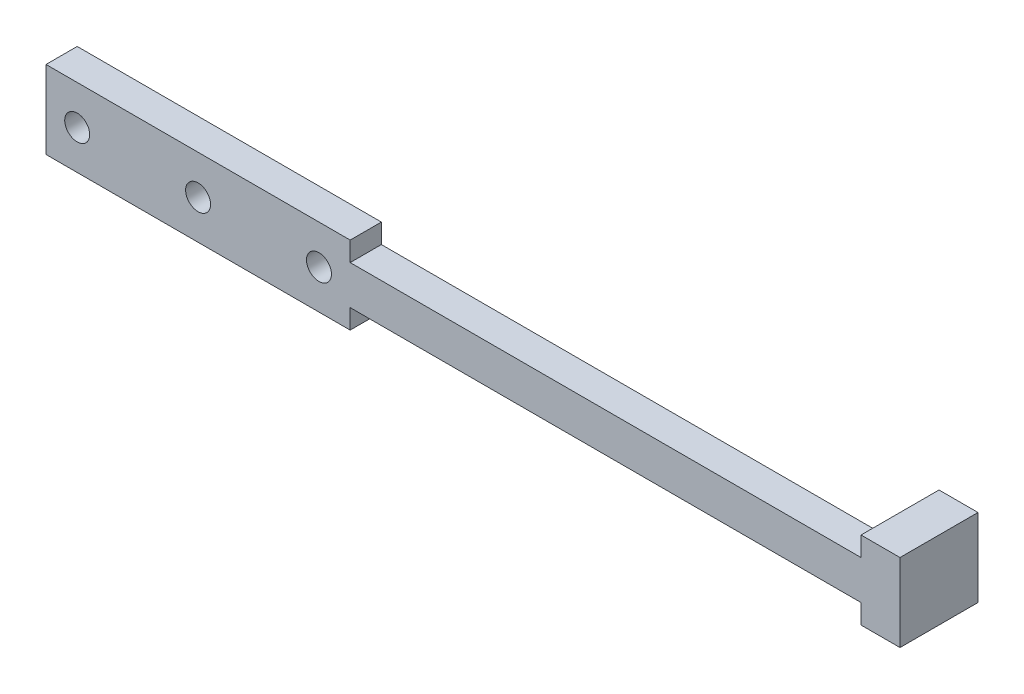
ISO-10303-21;
HEADER;
FILE_DESCRIPTION(('STEP AP214'),'2;1');
FILE_NAME('part.step','',(''),(''),'','','');
FILE_SCHEMA(('AUTOMOTIVE_DESIGN { 1 0 10303 214 1 1 1 1 }'));
ENDSEC;
DATA;
#1=APPLICATION_CONTEXT('core data for automotive mechanical design processes');
#2=APPLICATION_PROTOCOL_DEFINITION('international standard','automotive_design',2000,#1);
#3=PRODUCT_CONTEXT('',#1,'mechanical');
#4=PRODUCT('Part','Part','',(#3));
#5=PRODUCT_RELATED_PRODUCT_CATEGORY('part','',(#4));
#6=PRODUCT_DEFINITION_FORMATION('','',#4);
#7=PRODUCT_DEFINITION_CONTEXT('part definition',#1,'design');
#8=PRODUCT_DEFINITION('design','',#6,#7);
#9=PRODUCT_DEFINITION_SHAPE('','',#8);
#10=(LENGTH_UNIT() NAMED_UNIT(*) SI_UNIT(.MILLI.,.METRE.));
#11=(NAMED_UNIT(*) PLANE_ANGLE_UNIT() SI_UNIT($,.RADIAN.));
#12=(NAMED_UNIT(*) SI_UNIT($,.STERADIAN.) SOLID_ANGLE_UNIT());
#13=UNCERTAINTY_MEASURE_WITH_UNIT(LENGTH_MEASURE(1.E-05),#10,'distance_accuracy_value','');
#14=(GEOMETRIC_REPRESENTATION_CONTEXT(3) GLOBAL_UNCERTAINTY_ASSIGNED_CONTEXT((#13)) GLOBAL_UNIT_ASSIGNED_CONTEXT((#10,
#11,#12)) REPRESENTATION_CONTEXT('',''));
#15=CARTESIAN_POINT('',(0.,0.,0.));
#16=DIRECTION('',(0.,0.,1.));
#17=DIRECTION('',(1.,0.,0.));
#18=AXIS2_PLACEMENT_3D('',#15,#16,#17);
#19=CARTESIAN_POINT('',(-32.75,0.,4.));
#20=DIRECTION('',(1.,0.,0.));
#21=DIRECTION('',(0.,0.,-1.));
#22=AXIS2_PLACEMENT_3D('',#19,#20,#21);
#23=PLANE('',#22);
#24=DIRECTION('',(0.,-1.,0.));
#25=VECTOR('',#24,1.);
#26=CARTESIAN_POINT('',(-32.75,0.,0.));
#27=LINE('',#26,#25);
#28=CARTESIAN_POINT('',(-32.75,5.,0.));
#29=VERTEX_POINT('',#28);
#30=CARTESIAN_POINT('',(-32.75,2.5,0.));
#31=VERTEX_POINT('',#30);
#32=EDGE_CURVE('E187',#29,#31,#27,.T.);
#33=ORIENTED_EDGE('',*,*,#32,.F.);
#34=DIRECTION('',(0.,0.,-1.));
#35=VECTOR('',#34,1.);
#36=CARTESIAN_POINT('',(-32.75,5.,4.));
#37=LINE('',#36,#35);
#38=CARTESIAN_POINT('',(-32.75,5.,4.));
#39=VERTEX_POINT('',#38);
#40=EDGE_CURVE('E11',#39,#29,#37,.T.);
#41=ORIENTED_EDGE('',*,*,#40,.F.);
#42=DIRECTION('',(0.,-1.,0.));
#43=VECTOR('',#42,1.);
#44=CARTESIAN_POINT('',(-32.75,0.,4.));
#45=LINE('',#44,#43);
#46=CARTESIAN_POINT('',(-32.75,2.5,4.));
#47=VERTEX_POINT('',#46);
#48=EDGE_CURVE('E168',#39,#47,#45,.T.);
#49=ORIENTED_EDGE('',*,*,#48,.T.);
#50=DIRECTION('',(0.,0.,-1.));
#51=VECTOR('',#50,1.);
#52=CARTESIAN_POINT('',(-32.75,2.5,4.));
#53=LINE('',#52,#51);
#54=EDGE_CURVE('E52',#47,#31,#53,.T.);
#55=ORIENTED_EDGE('',*,*,#54,.T.);
#56=EDGE_LOOP('',(#33,#41,#49,#55));
#57=FACE_BOUND('',#56,.T.);
#58=ADVANCED_FACE('F35',(#57),#23,.T.);
#59=CARTESIAN_POINT('',(0.,5.,4.));
#60=DIRECTION('',(0.,1.,0.));
#61=DIRECTION('',(-1.,0.,0.));
#62=AXIS2_PLACEMENT_3D('',#59,#60,#61);
#63=PLANE('',#62);
#64=DIRECTION('',(1.,0.,0.));
#65=VECTOR('',#64,1.);
#66=CARTESIAN_POINT('',(0.,5.,0.));
#67=LINE('',#66,#65);
#68=CARTESIAN_POINT('',(-71.75,5.,0.));
#69=VERTEX_POINT('',#68);
#70=EDGE_CURVE('E189',#69,#29,#67,.T.);
#71=ORIENTED_EDGE('',*,*,#70,.F.);
#72=DIRECTION('',(0.,0.,-1.));
#73=VECTOR('',#72,1.);
#74=CARTESIAN_POINT('',(-71.75,5.,4.));
#75=LINE('',#74,#73);
#76=CARTESIAN_POINT('',(-71.75,5.,4.));
#77=VERTEX_POINT('',#76);
#78=EDGE_CURVE('E44',#77,#69,#75,.T.);
#79=ORIENTED_EDGE('',*,*,#78,.F.);
#80=DIRECTION('',(1.,0.,0.));
#81=VECTOR('',#80,1.);
#82=CARTESIAN_POINT('',(0.,5.,4.));
#83=LINE('',#82,#81);
#84=EDGE_CURVE('E170',#77,#39,#83,.T.);
#85=ORIENTED_EDGE('',*,*,#84,.T.);
#86=ORIENTED_EDGE('',*,*,#40,.T.);
#87=EDGE_LOOP('',(#71,#79,#85,#86));
#88=FACE_BOUND('',#87,.T.);
#89=ADVANCED_FACE('F222',(#88),#63,.T.);
#90=CARTESIAN_POINT('',(-71.75,0.,4.));
#91=DIRECTION('',(1.,0.,0.));
#92=DIRECTION('',(0.,0.,-1.));
#93=AXIS2_PLACEMENT_3D('',#90,#91,#92);
#94=PLANE('',#93);
#95=DIRECTION('',(0.,-1.,0.));
#96=VECTOR('',#95,1.);
#97=CARTESIAN_POINT('',(-71.75,0.,0.));
#98=LINE('',#97,#96);
#99=CARTESIAN_POINT('',(-71.75,-5.,0.));
#100=VERTEX_POINT('',#99);
#101=EDGE_CURVE('E193',#69,#100,#98,.T.);
#102=ORIENTED_EDGE('',*,*,#101,.T.);
#103=DIRECTION('',(0.,0.,-1.));
#104=VECTOR('',#103,1.);
#105=CARTESIAN_POINT('',(-71.75,-5.,4.));
#106=LINE('',#105,#104);
#107=CARTESIAN_POINT('',(-71.75,-5.,4.));
#108=VERTEX_POINT('',#107);
#109=EDGE_CURVE('E209',#108,#100,#106,.T.);
#110=ORIENTED_EDGE('',*,*,#109,.F.);
#111=DIRECTION('',(0.,-1.,0.));
#112=VECTOR('',#111,1.);
#113=CARTESIAN_POINT('',(-71.75,0.,4.));
#114=LINE('',#113,#112);
#115=EDGE_CURVE('E173',#77,#108,#114,.T.);
#116=ORIENTED_EDGE('',*,*,#115,.F.);
#117=ORIENTED_EDGE('',*,*,#78,.T.);
#118=EDGE_LOOP('',(#102,#110,#116,#117));
#119=FACE_BOUND('',#118,.T.);
#120=ADVANCED_FACE('F214',(#119),#94,.F.);
#121=CARTESIAN_POINT('',(0.,-5.,4.));
#122=DIRECTION('',(0.,1.,0.));
#123=DIRECTION('',(-1.,0.,0.));
#124=AXIS2_PLACEMENT_3D('',#121,#122,#123);
#125=PLANE('',#124);
#126=DIRECTION('',(1.,0.,0.));
#127=VECTOR('',#126,1.);
#128=CARTESIAN_POINT('',(0.,-5.,0.));
#129=LINE('',#128,#127);
#130=CARTESIAN_POINT('',(-32.75,-5.,0.));
#131=VERTEX_POINT('',#130);
#132=EDGE_CURVE('E196',#100,#131,#129,.T.);
#133=ORIENTED_EDGE('',*,*,#132,.T.);
#134=DIRECTION('',(0.,0.,-1.));
#135=VECTOR('',#134,1.);
#136=CARTESIAN_POINT('',(-32.75,-5.,4.));
#137=LINE('',#136,#135);
#138=CARTESIAN_POINT('',(-32.75,-5.,4.));
#139=VERTEX_POINT('',#138);
#140=EDGE_CURVE('E207',#139,#131,#137,.T.);
#141=ORIENTED_EDGE('',*,*,#140,.F.);
#142=DIRECTION('',(1.,0.,0.));
#143=VECTOR('',#142,1.);
#144=CARTESIAN_POINT('',(0.,-5.,4.));
#145=LINE('',#144,#143);
#146=EDGE_CURVE('E176',#108,#139,#145,.T.);
#147=ORIENTED_EDGE('',*,*,#146,.F.);
#148=ORIENTED_EDGE('',*,*,#109,.T.);
#149=EDGE_LOOP('',(#133,#141,#147,#148));
#150=FACE_BOUND('',#149,.T.);
#151=ADVANCED_FACE('F245',(#150),#125,.F.);
#152=CARTESIAN_POINT('',(-32.75,-2.5,0.));
#153=VERTEX_POINT('',#152);
#154=EDGE_CURVE('E190',#153,#131,#27,.T.);
#155=ORIENTED_EDGE('',*,*,#154,.F.);
#156=DIRECTION('',(0.,0.,-1.));
#157=VECTOR('',#156,1.);
#158=CARTESIAN_POINT('',(-32.75,-2.5,4.));
#159=LINE('',#158,#157);
#160=CARTESIAN_POINT('',(-32.75,-2.5,4.));
#161=VERTEX_POINT('',#160);
#162=EDGE_CURVE('E124',#161,#153,#159,.T.);
#163=ORIENTED_EDGE('',*,*,#162,.F.);
#164=EDGE_CURVE('E112',#161,#139,#45,.T.);
#165=ORIENTED_EDGE('',*,*,#164,.T.);
#166=ORIENTED_EDGE('',*,*,#140,.T.);
#167=EDGE_LOOP('',(#155,#163,#165,#166));
#168=FACE_BOUND('',#167,.T.);
#169=ADVANCED_FACE('F238',(#168),#23,.T.);
#170=CARTESIAN_POINT('',(0.,-2.5,4.));
#171=DIRECTION('',(0.,1.,0.));
#172=DIRECTION('',(0.,0.,1.));
#173=AXIS2_PLACEMENT_3D('',#170,#171,#172);
#174=PLANE('',#173);
#175=DIRECTION('',(1.,0.,0.));
#176=VECTOR('',#175,1.);
#177=CARTESIAN_POINT('',(0.,-2.5,0.));
#178=LINE('',#177,#176);
#179=CARTESIAN_POINT('',(32.75,-2.5,0.));
#180=VERTEX_POINT('',#179);
#181=EDGE_CURVE('E121',#153,#180,#178,.T.);
#182=ORIENTED_EDGE('',*,*,#181,.T.);
#183=DIRECTION('',(0.,0.,-1.));
#184=VECTOR('',#183,1.);
#185=CARTESIAN_POINT('',(32.75,-2.5,4.));
#186=LINE('',#185,#184);
#187=CARTESIAN_POINT('',(32.75,-2.5,4.));
#188=VERTEX_POINT('',#187);
#189=EDGE_CURVE('E118',#188,#180,#186,.T.);
#190=ORIENTED_EDGE('',*,*,#189,.F.);
#191=DIRECTION('',(1.,0.,0.));
#192=VECTOR('',#191,1.);
#193=CARTESIAN_POINT('',(0.,-2.5,4.));
#194=LINE('',#193,#192);
#195=EDGE_CURVE('E103',#161,#188,#194,.T.);
#196=ORIENTED_EDGE('',*,*,#195,.F.);
#197=ORIENTED_EDGE('',*,*,#162,.T.);
#198=EDGE_LOOP('',(#182,#190,#196,#197));
#199=FACE_BOUND('',#198,.T.);
#200=ADVANCED_FACE('F119',(#199),#174,.F.);
#201=CARTESIAN_POINT('',(-36.75,0.,4.));
#202=DIRECTION('',(0.,0.,-1.));
#203=DIRECTION('',(-1.,0.,0.));
#204=AXIS2_PLACEMENT_3D('',#201,#202,#203);
#205=CYLINDRICAL_SURFACE('',#204,1.60000000000001);
#206=CARTESIAN_POINT('',(-36.75,0.,4.));
#207=DIRECTION('',(0.,0.,1.));
#208=DIRECTION('',(1.,0.,0.));
#209=AXIS2_PLACEMENT_3D('',#206,#207,#208);
#210=CIRCLE('',#209,1.60000000000001);
#211=CARTESIAN_POINT('',(-35.15,0.,4.));
#212=VERTEX_POINT('',#211);
#213=EDGE_CURVE('E165',#212,#212,#210,.T.);
#214=ORIENTED_EDGE('',*,*,#213,.T.);
#215=EDGE_LOOP('',(#214));
#216=FACE_BOUND('',#215,.T.);
#217=CARTESIAN_POINT('',(-36.75,0.,0.));
#218=DIRECTION('',(0.,0.,1.));
#219=DIRECTION('',(1.,0.,0.));
#220=AXIS2_PLACEMENT_3D('',#217,#218,#219);
#221=CIRCLE('',#220,1.60000000000001);
#222=CARTESIAN_POINT('',(-35.15,0.,0.));
#223=VERTEX_POINT('',#222);
#224=EDGE_CURVE('E184',#223,#223,#221,.T.);
#225=ORIENTED_EDGE('',*,*,#224,.F.);
#226=EDGE_LOOP('',(#225));
#227=FACE_BOUND('',#226,.T.);
#228=ADVANCED_FACE('F251',(#216,#227),#205,.F.);
#229=CARTESIAN_POINT('',(-67.75,0.,4.));
#230=DIRECTION('',(0.,0.,-1.));
#231=DIRECTION('',(-1.,0.,0.));
#232=AXIS2_PLACEMENT_3D('',#229,#230,#231);
#233=CYLINDRICAL_SURFACE('',#232,1.60000000000001);
#234=CARTESIAN_POINT('',(-67.75,0.,4.));
#235=DIRECTION('',(0.,0.,1.));
#236=DIRECTION('',(1.,0.,0.));
#237=AXIS2_PLACEMENT_3D('',#234,#235,#236);
#238=CIRCLE('',#237,1.60000000000001);
#239=CARTESIAN_POINT('',(-66.15,0.,4.));
#240=VERTEX_POINT('',#239);
#241=EDGE_CURVE('E161',#240,#240,#238,.T.);
#242=ORIENTED_EDGE('',*,*,#241,.T.);
#243=EDGE_LOOP('',(#242));
#244=FACE_BOUND('',#243,.T.);
#245=CARTESIAN_POINT('',(-67.75,0.,0.));
#246=DIRECTION('',(0.,0.,1.));
#247=DIRECTION('',(1.,0.,0.));
#248=AXIS2_PLACEMENT_3D('',#245,#246,#247);
#249=CIRCLE('',#248,1.60000000000001);
#250=CARTESIAN_POINT('',(-66.15,0.,0.));
#251=VERTEX_POINT('',#250);
#252=EDGE_CURVE('E181',#251,#251,#249,.T.);
#253=ORIENTED_EDGE('',*,*,#252,.F.);
#254=EDGE_LOOP('',(#253));
#255=FACE_BOUND('',#254,.T.);
#256=ADVANCED_FACE('F232',(#244,#255),#233,.F.);
#257=CARTESIAN_POINT('',(-52.25,0.,4.));
#258=DIRECTION('',(0.,0.,-1.));
#259=DIRECTION('',(-1.,0.,0.));
#260=AXIS2_PLACEMENT_3D('',#257,#258,#259);
#261=CYLINDRICAL_SURFACE('',#260,1.60000000000001);
#262=CARTESIAN_POINT('',(-52.25,0.,4.));
#263=DIRECTION('',(0.,0.,1.));
#264=DIRECTION('',(1.,0.,0.));
#265=AXIS2_PLACEMENT_3D('',#262,#263,#264);
#266=CIRCLE('',#265,1.60000000000001);
#267=CARTESIAN_POINT('',(-50.65,0.,4.));
#268=VERTEX_POINT('',#267);
#269=EDGE_CURVE('E158',#268,#268,#266,.T.);
#270=ORIENTED_EDGE('',*,*,#269,.T.);
#271=EDGE_LOOP('',(#270));
#272=FACE_BOUND('',#271,.T.);
#273=CARTESIAN_POINT('',(-52.25,0.,0.));
#274=DIRECTION('',(0.,0.,1.));
#275=DIRECTION('',(1.,0.,0.));
#276=AXIS2_PLACEMENT_3D('',#273,#274,#275);
#277=CIRCLE('',#276,1.60000000000001);
#278=CARTESIAN_POINT('',(-50.65,0.,0.));
#279=VERTEX_POINT('',#278);
#280=EDGE_CURVE('E150',#279,#279,#277,.T.);
#281=ORIENTED_EDGE('',*,*,#280,.F.);
#282=EDGE_LOOP('',(#281));
#283=FACE_BOUND('',#282,.T.);
#284=ADVANCED_FACE('F37',(#272,#283),#261,.F.);
#285=CARTESIAN_POINT('',(0.,2.5,4.));
#286=DIRECTION('',(0.,1.,0.));
#287=DIRECTION('',(0.,0.,1.));
#288=AXIS2_PLACEMENT_3D('',#285,#286,#287);
#289=PLANE('',#288);
#290=DIRECTION('',(1.,0.,0.));
#291=VECTOR('',#290,1.);
#292=CARTESIAN_POINT('',(0.,2.5,0.));
#293=LINE('',#292,#291);
#294=CARTESIAN_POINT('',(32.75,2.5,0.));
#295=VERTEX_POINT('',#294);
#296=EDGE_CURVE('E162',#31,#295,#293,.T.);
#297=ORIENTED_EDGE('',*,*,#296,.F.);
#298=ORIENTED_EDGE('',*,*,#54,.F.);
#299=DIRECTION('',(1.,0.,0.));
#300=VECTOR('',#299,1.);
#301=CARTESIAN_POINT('',(0.,2.5,4.));
#302=LINE('',#301,#300);
#303=CARTESIAN_POINT('',(32.75,2.5,4.));
#304=VERTEX_POINT('',#303);
#305=EDGE_CURVE('E114',#47,#304,#302,.T.);
#306=ORIENTED_EDGE('',*,*,#305,.T.);
#307=DIRECTION('',(0.,0.,-1.));
#308=VECTOR('',#307,1.);
#309=CARTESIAN_POINT('',(32.75,2.5,4.));
#310=LINE('',#309,#308);
#311=EDGE_CURVE('E75',#304,#295,#310,.T.);
#312=ORIENTED_EDGE('',*,*,#311,.T.);
#313=EDGE_LOOP('',(#297,#298,#306,#312));
#314=FACE_BOUND('',#313,.T.);
#315=ADVANCED_FACE('F223',(#314),#289,.T.);
#316=CARTESIAN_POINT('',(0.,0.,4.));
#317=DIRECTION('',(0.,0.,1.));
#318=DIRECTION('',(1.,0.,0.));
#319=AXIS2_PLACEMENT_3D('',#316,#317,#318);
#320=PLANE('',#319);
#321=ORIENTED_EDGE('',*,*,#269,.F.);
#322=EDGE_LOOP('',(#321));
#323=FACE_BOUND('',#322,.T.);
#324=ORIENTED_EDGE('',*,*,#241,.F.);
#325=EDGE_LOOP('',(#324));
#326=FACE_BOUND('',#325,.T.);
#327=ORIENTED_EDGE('',*,*,#213,.F.);
#328=EDGE_LOOP('',(#327));
#329=FACE_BOUND('',#328,.T.);
#330=ORIENTED_EDGE('',*,*,#48,.F.);
#331=ORIENTED_EDGE('',*,*,#84,.F.);
#332=ORIENTED_EDGE('',*,*,#115,.T.);
#333=ORIENTED_EDGE('',*,*,#146,.T.);
#334=ORIENTED_EDGE('',*,*,#164,.F.);
#335=ORIENTED_EDGE('',*,*,#195,.T.);
#336=DIRECTION('',(0.,-1.,0.));
#337=VECTOR('',#336,1.);
#338=CARTESIAN_POINT('',(32.75,5.,4.));
#339=LINE('',#338,#337);
#340=CARTESIAN_POINT('',(32.75,-5.,4.));
#341=VERTEX_POINT('',#340);
#342=EDGE_CURVE('E109',#188,#341,#339,.T.);
#343=ORIENTED_EDGE('',*,*,#342,.T.);
#344=DIRECTION('',(1.,0.,0.));
#345=VECTOR('',#344,1.);
#346=CARTESIAN_POINT('',(32.75,-5.,4.));
#347=LINE('',#346,#345);
#348=CARTESIAN_POINT('',(37.75,-5.,4.));
#349=VERTEX_POINT('',#348);
#350=EDGE_CURVE('E134',#341,#349,#347,.T.);
#351=ORIENTED_EDGE('',*,*,#350,.T.);
#352=DIRECTION('',(0.,1.,0.));
#353=VECTOR('',#352,1.);
#354=CARTESIAN_POINT('',(37.75,5.,4.));
#355=LINE('',#354,#353);
#356=CARTESIAN_POINT('',(37.75,5.,4.));
#357=VERTEX_POINT('',#356);
#358=EDGE_CURVE('E140',#349,#357,#355,.T.);
#359=ORIENTED_EDGE('',*,*,#358,.T.);
#360=DIRECTION('',(-1.,0.,0.));
#361=VECTOR('',#360,1.);
#362=CARTESIAN_POINT('',(32.75,5.,4.));
#363=LINE('',#362,#361);
#364=CARTESIAN_POINT('',(32.75,5.,4.));
#365=VERTEX_POINT('',#364);
#366=EDGE_CURVE('E143',#357,#365,#363,.T.);
#367=ORIENTED_EDGE('',*,*,#366,.T.);
#368=EDGE_CURVE('E131',#365,#304,#339,.T.);
#369=ORIENTED_EDGE('',*,*,#368,.T.);
#370=ORIENTED_EDGE('',*,*,#305,.F.);
#371=EDGE_LOOP('',(#330,#331,#332,#333,#334,#335,#343,#351,#359,#367,#369,#370));
#372=FACE_BOUND('',#371,.T.);
#373=ADVANCED_FACE('F105',(#323,#326,#329,#372),#320,.T.);
#374=CARTESIAN_POINT('',(0.,0.,0.));
#375=DIRECTION('',(0.,0.,1.));
#376=DIRECTION('',(1.,0.,0.));
#377=AXIS2_PLACEMENT_3D('',#374,#375,#376);
#378=PLANE('',#377);
#379=ORIENTED_EDGE('',*,*,#280,.T.);
#380=EDGE_LOOP('',(#379));
#381=FACE_BOUND('',#380,.T.);
#382=ORIENTED_EDGE('',*,*,#252,.T.);
#383=EDGE_LOOP('',(#382));
#384=FACE_BOUND('',#383,.T.);
#385=ORIENTED_EDGE('',*,*,#224,.T.);
#386=EDGE_LOOP('',(#385));
#387=FACE_BOUND('',#386,.T.);
#388=ORIENTED_EDGE('',*,*,#32,.T.);
#389=ORIENTED_EDGE('',*,*,#296,.T.);
#390=DIRECTION('',(0.,-1.,0.));
#391=VECTOR('',#390,1.);
#392=CARTESIAN_POINT('',(32.75,0.,0.));
#393=LINE('',#392,#391);
#394=EDGE_CURVE('E200',#295,#180,#393,.T.);
#395=ORIENTED_EDGE('',*,*,#394,.T.);
#396=ORIENTED_EDGE('',*,*,#181,.F.);
#397=ORIENTED_EDGE('',*,*,#154,.T.);
#398=ORIENTED_EDGE('',*,*,#132,.F.);
#399=ORIENTED_EDGE('',*,*,#101,.F.);
#400=ORIENTED_EDGE('',*,*,#70,.T.);
#401=EDGE_LOOP('',(#388,#389,#395,#396,#397,#398,#399,#400));
#402=FACE_BOUND('',#401,.T.);
#403=ADVANCED_FACE('F220',(#381,#384,#387,#402),#378,.F.);
#404=CARTESIAN_POINT('',(32.75,5.,-6.));
#405=DIRECTION('',(-1.,0.,0.));
#406=DIRECTION('',(0.,0.,1.));
#407=AXIS2_PLACEMENT_3D('',#404,#405,#406);
#408=PLANE('',#407);
#409=ORIENTED_EDGE('',*,*,#311,.F.);
#410=ORIENTED_EDGE('',*,*,#368,.F.);
#411=DIRECTION('',(0.,0.,1.));
#412=VECTOR('',#411,1.);
#413=CARTESIAN_POINT('',(32.75,5.,-6.));
#414=LINE('',#413,#412);
#415=CARTESIAN_POINT('',(32.75,5.,-6.));
#416=VERTEX_POINT('',#415);
#417=EDGE_CURVE('E147',#416,#365,#414,.T.);
#418=ORIENTED_EDGE('',*,*,#417,.F.);
#419=DIRECTION('',(0.,-1.,0.));
#420=VECTOR('',#419,1.);
#421=CARTESIAN_POINT('',(32.75,5.,-6.));
#422=LINE('',#421,#420);
#423=CARTESIAN_POINT('',(32.75,-5.,-6.));
#424=VERTEX_POINT('',#423);
#425=EDGE_CURVE('E146',#416,#424,#422,.T.);
#426=ORIENTED_EDGE('',*,*,#425,.T.);
#427=DIRECTION('',(0.,0.,1.));
#428=VECTOR('',#427,1.);
#429=CARTESIAN_POINT('',(32.75,-5.,-6.));
#430=LINE('',#429,#428);
#431=EDGE_CURVE('E129',#424,#341,#430,.T.);
#432=ORIENTED_EDGE('',*,*,#431,.T.);
#433=ORIENTED_EDGE('',*,*,#342,.F.);
#434=ORIENTED_EDGE('',*,*,#189,.T.);
#435=ORIENTED_EDGE('',*,*,#394,.F.);
#436=EDGE_LOOP('',(#409,#410,#418,#426,#432,#433,#434,#435));
#437=FACE_BOUND('',#436,.T.);
#438=ADVANCED_FACE('F126',(#437),#408,.T.);
#439=CARTESIAN_POINT('',(32.75,5.,-6.));
#440=DIRECTION('',(0.,1.,0.));
#441=DIRECTION('',(-1.,0.,0.));
#442=AXIS2_PLACEMENT_3D('',#439,#440,#441);
#443=PLANE('',#442);
#444=ORIENTED_EDGE('',*,*,#366,.F.);
#445=DIRECTION('',(0.,0.,1.));
#446=VECTOR('',#445,1.);
#447=CARTESIAN_POINT('',(37.75,5.,-6.));
#448=LINE('',#447,#446);
#449=CARTESIAN_POINT('',(37.75,5.,-6.));
#450=VERTEX_POINT('',#449);
#451=EDGE_CURVE('E151',#450,#357,#448,.T.);
#452=ORIENTED_EDGE('',*,*,#451,.F.);
#453=DIRECTION('',(-1.,0.,0.));
#454=VECTOR('',#453,1.);
#455=CARTESIAN_POINT('',(32.75,5.,-6.));
#456=LINE('',#455,#454);
#457=EDGE_CURVE('E137',#450,#416,#456,.T.);
#458=ORIENTED_EDGE('',*,*,#457,.T.);
#459=ORIENTED_EDGE('',*,*,#417,.T.);
#460=EDGE_LOOP('',(#444,#452,#458,#459));
#461=FACE_BOUND('',#460,.T.);
#462=ADVANCED_FACE('F266',(#461),#443,.T.);
#463=CARTESIAN_POINT('',(37.75,5.,-6.));
#464=DIRECTION('',(1.,0.,0.));
#465=DIRECTION('',(0.,0.,-1.));
#466=AXIS2_PLACEMENT_3D('',#463,#464,#465);
#467=PLANE('',#466);
#468=ORIENTED_EDGE('',*,*,#358,.F.);
#469=DIRECTION('',(0.,0.,1.));
#470=VECTOR('',#469,1.);
#471=CARTESIAN_POINT('',(37.75,-5.,-6.));
#472=LINE('',#471,#470);
#473=CARTESIAN_POINT('',(37.75,-5.,-6.));
#474=VERTEX_POINT('',#473);
#475=EDGE_CURVE('E154',#474,#349,#472,.T.);
#476=ORIENTED_EDGE('',*,*,#475,.F.);
#477=DIRECTION('',(0.,1.,0.));
#478=VECTOR('',#477,1.);
#479=CARTESIAN_POINT('',(37.75,5.,-6.));
#480=LINE('',#479,#478);
#481=EDGE_CURVE('E291',#474,#450,#480,.T.);
#482=ORIENTED_EDGE('',*,*,#481,.T.);
#483=ORIENTED_EDGE('',*,*,#451,.T.);
#484=EDGE_LOOP('',(#468,#476,#482,#483));
#485=FACE_BOUND('',#484,.T.);
#486=ADVANCED_FACE('F294',(#485),#467,.T.);
#487=CARTESIAN_POINT('',(32.75,-5.,-6.));
#488=DIRECTION('',(0.,-1.,0.));
#489=DIRECTION('',(1.,0.,0.));
#490=AXIS2_PLACEMENT_3D('',#487,#488,#489);
#491=PLANE('',#490);
#492=ORIENTED_EDGE('',*,*,#350,.F.);
#493=ORIENTED_EDGE('',*,*,#431,.F.);
#494=DIRECTION('',(1.,0.,0.));
#495=VECTOR('',#494,1.);
#496=CARTESIAN_POINT('',(32.75,-5.,-6.));
#497=LINE('',#496,#495);
#498=EDGE_CURVE('E285',#424,#474,#497,.T.);
#499=ORIENTED_EDGE('',*,*,#498,.T.);
#500=ORIENTED_EDGE('',*,*,#475,.T.);
#501=EDGE_LOOP('',(#492,#493,#499,#500));
#502=FACE_BOUND('',#501,.T.);
#503=ADVANCED_FACE('F284',(#502),#491,.T.);
#504=CARTESIAN_POINT('',(0.,0.,-6.));
#505=DIRECTION('',(0.,0.,1.));
#506=DIRECTION('',(1.,0.,0.));
#507=AXIS2_PLACEMENT_3D('',#504,#505,#506);
#508=PLANE('',#507);
#509=ORIENTED_EDGE('',*,*,#425,.F.);
#510=ORIENTED_EDGE('',*,*,#457,.F.);
#511=ORIENTED_EDGE('',*,*,#481,.F.);
#512=ORIENTED_EDGE('',*,*,#498,.F.);
#513=EDGE_LOOP('',(#509,#510,#511,#512));
#514=FACE_BOUND('',#513,.T.);
#515=ADVANCED_FACE('F289',(#514),#508,.F.);
#516=CLOSED_SHELL('',(#58,#89,#120,#151,#169,#200,#228,#256,#284,#315,#373,#403,#438,#462,#486,
#503,#515));
#517=MANIFOLD_SOLID_BREP('B2',#516);
#518=ADVANCED_BREP_SHAPE_REPRESENTATION('',(#18,#517),#14);
#519=SHAPE_DEFINITION_REPRESENTATION(#9,#518);
ENDSEC;
END-ISO-10303-21;
